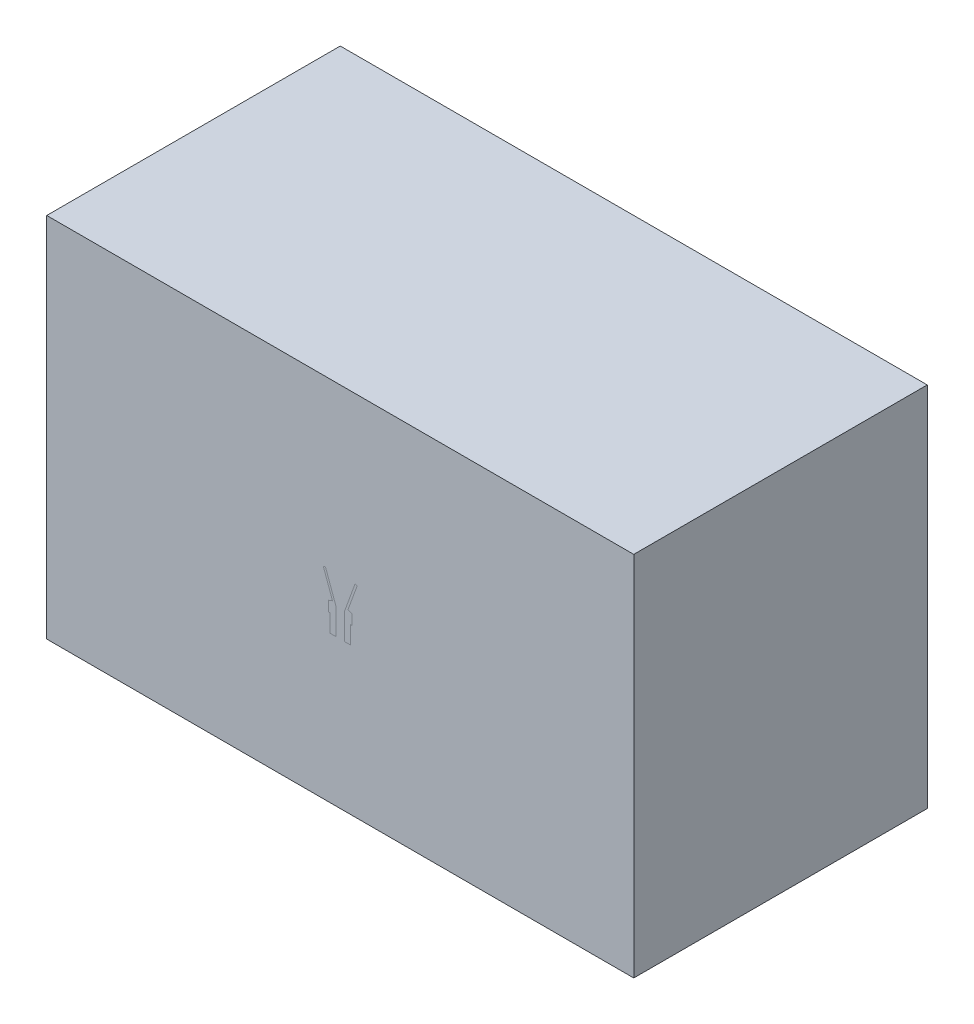
ISO-10303-21;
HEADER;
FILE_DESCRIPTION(('STEP AP214'),'2;1');
FILE_NAME('part.step','',(''),(''),'','','');
FILE_SCHEMA(('AUTOMOTIVE_DESIGN { 1 0 10303 214 1 1 1 1 }'));
ENDSEC;
DATA;
#1=APPLICATION_CONTEXT('core data for automotive mechanical design processes');
#2=APPLICATION_PROTOCOL_DEFINITION('international standard','automotive_design',2000,#1);
#3=PRODUCT_CONTEXT('',#1,'mechanical');
#4=PRODUCT('Part','Part','',(#3));
#5=PRODUCT_RELATED_PRODUCT_CATEGORY('part','',(#4));
#6=PRODUCT_DEFINITION_FORMATION('','',#4);
#7=PRODUCT_DEFINITION_CONTEXT('part definition',#1,'design');
#8=PRODUCT_DEFINITION('design','',#6,#7);
#9=PRODUCT_DEFINITION_SHAPE('','',#8);
#10=(LENGTH_UNIT() NAMED_UNIT(*) SI_UNIT(.MILLI.,.METRE.));
#11=(NAMED_UNIT(*) PLANE_ANGLE_UNIT() SI_UNIT($,.RADIAN.));
#12=(NAMED_UNIT(*) SI_UNIT($,.STERADIAN.) SOLID_ANGLE_UNIT());
#13=UNCERTAINTY_MEASURE_WITH_UNIT(LENGTH_MEASURE(1.E-05),#10,'distance_accuracy_value','');
#14=(GEOMETRIC_REPRESENTATION_CONTEXT(3) GLOBAL_UNCERTAINTY_ASSIGNED_CONTEXT((#13)) GLOBAL_UNIT_ASSIGNED_CONTEXT((#10,
#11,#12)) REPRESENTATION_CONTEXT('',''));
#15=CARTESIAN_POINT('',(0.,0.,0.));
#16=DIRECTION('',(0.,0.,1.));
#17=DIRECTION('',(1.,0.,0.));
#18=AXIS2_PLACEMENT_3D('',#15,#16,#17);
#19=CARTESIAN_POINT('',(0.,941.954291822987,0.));
#20=DIRECTION('',(0.,1.,0.));
#21=DIRECTION('',(0.,0.,1.));
#22=AXIS2_PLACEMENT_3D('',#19,#20,#21);
#23=TOROIDAL_SURFACE('',#22,265.023984913654,12.7);
#24=CARTESIAN_POINT('',(0.,946.297947643223,0.));
#25=DIRECTION('',(0.,-1.,0.));
#26=DIRECTION('',(0.,0.,-1.));
#27=AXIS2_PLACEMENT_3D('',#24,#25,#26);
#28=CIRCLE('',#27,253.089888629673);
#29=CARTESIAN_POINT('',(253.089888629673,946.297947643223,0.));
#30=VERTEX_POINT('',#29);
#31=CARTESIAN_POINT('',(-253.089888629673,946.297947643223,0.));
#32=VERTEX_POINT('',#31);
#33=EDGE_CURVE('E178',#30,#32,#28,.F.);
#34=ORIENTED_EDGE('',*,*,#33,.F.);
#35=CARTESIAN_POINT('',(265.023984913654,941.954291822987,0.));
#36=DIRECTION('',(0.,0.,1.));
#37=DIRECTION('',(1.,0.,0.));
#38=AXIS2_PLACEMENT_3D('',#35,#36,#37);
#39=CIRCLE('',#38,12.7);
#40=CARTESIAN_POINT('',(269.36764073389,953.888388106968,0.));
#41=VERTEX_POINT('',#40);
#42=EDGE_CURVE('E214',#30,#41,#39,.F.);
#43=ORIENTED_EDGE('',*,*,#42,.T.);
#44=CARTESIAN_POINT('',(0.,953.888388106968,0.));
#45=DIRECTION('',(0.,1.,0.));
#46=DIRECTION('',(0.,0.,1.));
#47=AXIS2_PLACEMENT_3D('',#44,#45,#46);
#48=CIRCLE('',#47,269.36764073389);
#49=CARTESIAN_POINT('',(-269.36764073389,953.888388106968,0.));
#50=VERTEX_POINT('',#49);
#51=EDGE_CURVE('E172',#50,#41,#48,.F.);
#52=ORIENTED_EDGE('',*,*,#51,.F.);
#53=CARTESIAN_POINT('',(-265.023984913654,941.954291822987,0.));
#54=DIRECTION('',(0.,0.,1.));
#55=DIRECTION('',(1.,0.,0.));
#56=AXIS2_PLACEMENT_3D('',#53,#54,#55);
#57=CIRCLE('',#56,12.7);
#58=EDGE_CURVE('E180',#50,#32,#57,.F.);
#59=ORIENTED_EDGE('',*,*,#58,.T.);
#60=EDGE_LOOP('',(#34,#43,#52,#59));
#61=FACE_BOUND('',#60,.T.);
#62=ADVANCED_FACE('F53',(#61),#23,.T.);
#63=CARTESIAN_POINT('',(0.,937.610636002752,0.));
#64=DIRECTION('',(0.,1.,0.));
#65=DIRECTION('',(0.,0.,1.));
#66=AXIS2_PLACEMENT_3D('',#63,#64,#65);
#67=TOROIDAL_SURFACE('',#66,276.958081197635,12.7);
#68=CARTESIAN_POINT('',(0.,949.544732286733,0.));
#69=DIRECTION('',(0.,1.,0.));
#70=DIRECTION('',(0.,0.,1.));
#71=AXIS2_PLACEMENT_3D('',#68,#69,#70);
#72=CIRCLE('',#71,281.301737017871);
#73=CARTESIAN_POINT('',(281.301737017871,949.544732286733,0.));
#74=VERTEX_POINT('',#73);
#75=CARTESIAN_POINT('',(-281.301737017871,949.544732286733,0.));
#76=VERTEX_POINT('',#75);
#77=EDGE_CURVE('E175',#74,#76,#72,.T.);
#78=ORIENTED_EDGE('',*,*,#77,.F.);
#79=CARTESIAN_POINT('',(276.958081197635,937.610636002752,0.));
#80=DIRECTION('',(0.,0.,1.));
#81=DIRECTION('',(1.,0.,0.));
#82=AXIS2_PLACEMENT_3D('',#79,#80,#81);
#83=CIRCLE('',#82,12.7);
#84=CARTESIAN_POINT('',(288.892177481616,933.266980182516,0.));
#85=VERTEX_POINT('',#84);
#86=EDGE_CURVE('E242',#74,#85,#83,.F.);
#87=ORIENTED_EDGE('',*,*,#86,.T.);
#88=CARTESIAN_POINT('',(0.,933.266980182516,0.));
#89=DIRECTION('',(0.,-1.,0.));
#90=DIRECTION('',(0.,0.,-1.));
#91=AXIS2_PLACEMENT_3D('',#88,#89,#90);
#92=CIRCLE('',#91,288.892177481616);
#93=CARTESIAN_POINT('',(-288.892177481616,933.266980182516,0.));
#94=VERTEX_POINT('',#93);
#95=EDGE_CURVE('E169',#94,#85,#92,.T.);
#96=ORIENTED_EDGE('',*,*,#95,.F.);
#97=CARTESIAN_POINT('',(-276.958081197635,937.610636002752,0.));
#98=DIRECTION('',(0.,0.,1.));
#99=DIRECTION('',(1.,0.,0.));
#100=AXIS2_PLACEMENT_3D('',#97,#98,#99);
#101=CIRCLE('',#100,12.7);
#102=EDGE_CURVE('E226',#94,#76,#101,.F.);
#103=ORIENTED_EDGE('',*,*,#102,.T.);
#104=EDGE_LOOP('',(#78,#87,#96,#103));
#105=FACE_BOUND('',#104,.T.);
#106=ADVANCED_FACE('F235',(#105),#67,.T.);
#107=CARTESIAN_POINT('',(0.,443.563884070015,0.));
#108=DIRECTION('',(0.,1.,0.));
#109=DIRECTION('',(0.,0.,1.));
#110=AXIS2_PLACEMENT_3D('',#107,#108,#109);
#111=TOROIDAL_SURFACE('',#110,151.2,76.2);
#112=CARTESIAN_POINT('',(0.,443.563884070015,0.));
#113=DIRECTION('',(0.,1.,0.));
#114=DIRECTION('',(0.,0.,1.));
#115=AXIS2_PLACEMENT_3D('',#112,#113,#114);
#116=CIRCLE('',#115,75.);
#117=CARTESIAN_POINT('',(75.,443.563884070015,0.));
#118=VERTEX_POINT('',#117);
#119=CARTESIAN_POINT('',(-75.,443.563884070015,0.));
#120=VERTEX_POINT('',#119);
#121=EDGE_CURVE('E163',#118,#120,#116,.T.);
#122=ORIENTED_EDGE('',*,*,#121,.F.);
#123=CARTESIAN_POINT('',(151.2,443.563884070015,0.));
#124=DIRECTION('',(0.,0.,1.));
#125=DIRECTION('',(1.,0.,0.));
#126=AXIS2_PLACEMENT_3D('',#123,#124,#125);
#127=CIRCLE('',#126,76.2);
#128=CARTESIAN_POINT('',(79.5954222961136,469.625818991431,0.));
#129=VERTEX_POINT('',#128);
#130=EDGE_CURVE('E244',#118,#129,#127,.F.);
#131=ORIENTED_EDGE('',*,*,#130,.T.);
#132=CARTESIAN_POINT('',(0.,469.625818991431,0.));
#133=DIRECTION('',(0.,1.,0.));
#134=DIRECTION('',(0.,0.,1.));
#135=AXIS2_PLACEMENT_3D('',#132,#133,#134);
#136=CIRCLE('',#135,79.5954222961136);
#137=CARTESIAN_POINT('',(-79.5954222961136,469.625818991431,0.));
#138=VERTEX_POINT('',#137);
#139=EDGE_CURVE('E158',#138,#129,#136,.F.);
#140=ORIENTED_EDGE('',*,*,#139,.F.);
#141=CARTESIAN_POINT('',(-151.2,443.563884070015,0.));
#142=DIRECTION('',(0.,0.,1.));
#143=DIRECTION('',(1.,0.,0.));
#144=AXIS2_PLACEMENT_3D('',#141,#142,#143);
#145=CIRCLE('',#144,76.2);
#146=EDGE_CURVE('E224',#138,#120,#145,.F.);
#147=ORIENTED_EDGE('',*,*,#146,.T.);
#148=EDGE_LOOP('',(#122,#131,#140,#147));
#149=FACE_BOUND('',#148,.T.);
#150=ADVANCED_FACE('F281',(#149),#111,.T.);
#151=CARTESIAN_POINT('',(0.,457.,0.));
#152=DIRECTION('',(0.,1.,0.));
#153=DIRECTION('',(0.,0.,1.));
#154=AXIS2_PLACEMENT_3D('',#151,#152,#153);
#155=CONICAL_SURFACE('',#154,75.,0.349065850398861);
#156=DIRECTION('',(0.342020143325664,0.93969262078591,0.));
#157=VECTOR('',#156,1.);
#158=CARTESIAN_POINT('',(0.,250.9391935409,0.));
#159=LINE('',#158,#157);
#160=EDGE_CURVE('E241',#30,#129,#159,.F.);
#161=ORIENTED_EDGE('',*,*,#160,.F.);
#162=ORIENTED_EDGE('',*,*,#33,.T.);
#163=DIRECTION('',(0.342020143325664,-0.93969262078591,0.));
#164=VECTOR('',#163,1.);
#165=CARTESIAN_POINT('',(0.,250.9391935409,0.));
#166=LINE('',#165,#164);
#167=EDGE_CURVE('E186',#138,#32,#166,.F.);
#168=ORIENTED_EDGE('',*,*,#167,.F.);
#169=ORIENTED_EDGE('',*,*,#139,.T.);
#170=EDGE_LOOP('',(#161,#162,#168,#169));
#171=FACE_BOUND('',#170,.T.);
#172=ADVANCED_FACE('F273',(#171),#155,.F.);
#173=CARTESIAN_POINT('',(0.,958.232043927204,0.));
#174=DIRECTION('',(0.,-1.,0.));
#175=DIRECTION('',(0.,0.,-1.));
#176=AXIS2_PLACEMENT_3D('',#173,#174,#175);
#177=CONICAL_SURFACE('',#176,257.433544449909,1.22173047639604);
#178=DIRECTION('',(-0.93969262078591,-0.342020143325664,0.));
#179=VECTOR('',#178,1.);
#180=CARTESIAN_POINT('',(0.,1051.93019140862,0.));
#181=LINE('',#180,#179);
#182=EDGE_CURVE('E190',#50,#76,#181,.T.);
#183=ORIENTED_EDGE('',*,*,#182,.F.);
#184=ORIENTED_EDGE('',*,*,#51,.T.);
#185=DIRECTION('',(-0.93969262078591,0.342020143325664,0.));
#186=VECTOR('',#185,1.);
#187=CARTESIAN_POINT('',(0.,1051.93019140862,0.));
#188=LINE('',#187,#186);
#189=EDGE_CURVE('E239',#74,#41,#188,.T.);
#190=ORIENTED_EDGE('',*,*,#189,.F.);
#191=ORIENTED_EDGE('',*,*,#77,.T.);
#192=EDGE_LOOP('',(#183,#184,#190,#191));
#193=FACE_BOUND('',#192,.T.);
#194=ADVANCED_FACE('F238',(#193),#177,.T.);
#195=CARTESIAN_POINT('',(0.,945.201076466497,0.));
#196=DIRECTION('',(0.,1.,0.));
#197=DIRECTION('',(0.,0.,1.));
#198=AXIS2_PLACEMENT_3D('',#195,#196,#197);
#199=CONICAL_SURFACE('',#198,293.235833301852,0.34906585039886);
#200=DIRECTION('',(0.342020143325663,0.93969262078591,0.));
#201=VECTOR('',#200,1.);
#202=CARTESIAN_POINT('',(0.,139.542245894684,0.));
#203=LINE('',#202,#201);
#204=CARTESIAN_POINT('',(133.634704911401,506.700580094249,0.));
#205=VERTEX_POINT('',#204);
#206=EDGE_CURVE('E249',#205,#85,#203,.T.);
#207=ORIENTED_EDGE('',*,*,#206,.F.);
#208=CARTESIAN_POINT('',(0.,506.700580094249,0.));
#209=DIRECTION('',(0.,-1.,0.));
#210=DIRECTION('',(0.,0.,-1.));
#211=AXIS2_PLACEMENT_3D('',#208,#209,#210);
#212=CIRCLE('',#211,133.634704911402);
#213=CARTESIAN_POINT('',(-133.634704911401,506.700580094249,0.));
#214=VERTEX_POINT('',#213);
#215=EDGE_CURVE('E146',#214,#205,#212,.T.);
#216=ORIENTED_EDGE('',*,*,#215,.F.);
#217=DIRECTION('',(0.342020143325663,-0.93969262078591,0.));
#218=VECTOR('',#217,1.);
#219=CARTESIAN_POINT('',(0.,139.542245894684,0.));
#220=LINE('',#219,#218);
#221=EDGE_CURVE('E222',#94,#214,#220,.T.);
#222=ORIENTED_EDGE('',*,*,#221,.F.);
#223=ORIENTED_EDGE('',*,*,#95,.T.);
#224=EDGE_LOOP('',(#207,#216,#222,#223));
#225=FACE_BOUND('',#224,.T.);
#226=ADVANCED_FACE('F265',(#225),#199,.T.);
#227=CARTESIAN_POINT('',(0.,506.700580094249,0.));
#228=DIRECTION('',(0.,-1.,0.));
#229=DIRECTION('',(0.,0.,-1.));
#230=AXIS2_PLACEMENT_3D('',#227,#228,#229);
#231=CONICAL_SURFACE('',#230,133.634704911402,1.22173047639604);
#232=DIRECTION('',(-0.93969262078591,-0.342020143325663,0.));
#233=VECTOR('',#232,1.);
#234=CARTESIAN_POINT('',(0.,555.339634946945,0.));
#235=LINE('',#234,#233);
#236=CARTESIAN_POINT('',(-200.4,482.4,0.));
#237=VERTEX_POINT('',#236);
#238=EDGE_CURVE('E220',#214,#237,#235,.T.);
#239=ORIENTED_EDGE('',*,*,#238,.F.);
#240=ORIENTED_EDGE('',*,*,#215,.T.);
#241=DIRECTION('',(-0.93969262078591,0.342020143325663,0.));
#242=VECTOR('',#241,1.);
#243=CARTESIAN_POINT('',(0.,555.339634946945,0.));
#244=LINE('',#243,#242);
#245=CARTESIAN_POINT('',(200.4,482.4,0.));
#246=VERTEX_POINT('',#245);
#247=EDGE_CURVE('E251',#246,#205,#244,.T.);
#248=ORIENTED_EDGE('',*,*,#247,.F.);
#249=CARTESIAN_POINT('',(0.,482.4,0.));
#250=DIRECTION('',(0.,-1.,0.));
#251=DIRECTION('',(0.,0.,-1.));
#252=AXIS2_PLACEMENT_3D('',#249,#250,#251);
#253=CIRCLE('',#252,200.4);
#254=EDGE_CURVE('E196',#237,#246,#253,.T.);
#255=ORIENTED_EDGE('',*,*,#254,.F.);
#256=EDGE_LOOP('',(#239,#240,#248,#255));
#257=FACE_BOUND('',#256,.T.);
#258=ADVANCED_FACE('F260',(#257),#231,.T.);
#259=CARTESIAN_POINT('',(0.,0.,0.));
#260=DIRECTION('',(0.,-1.,0.));
#261=DIRECTION('',(0.,0.,-1.));
#262=AXIS2_PLACEMENT_3D('',#259,#260,#261);
#263=CYLINDRICAL_SURFACE('',#262,200.4);
#264=DIRECTION('',(0.,-1.,0.));
#265=VECTOR('',#264,1.);
#266=CARTESIAN_POINT('',(-200.4,0.,0.));
#267=LINE('',#266,#265);
#268=CARTESIAN_POINT('',(-200.4,307.,0.));
#269=VERTEX_POINT('',#268);
#270=EDGE_CURVE('E213',#237,#269,#267,.T.);
#271=ORIENTED_EDGE('',*,*,#270,.F.);
#272=ORIENTED_EDGE('',*,*,#254,.T.);
#273=DIRECTION('',(0.,-1.,0.));
#274=VECTOR('',#273,1.);
#275=CARTESIAN_POINT('',(200.4,0.,0.));
#276=LINE('',#275,#274);
#277=CARTESIAN_POINT('',(200.4,307.,0.));
#278=VERTEX_POINT('',#277);
#279=EDGE_CURVE('E153',#278,#246,#276,.F.);
#280=ORIENTED_EDGE('',*,*,#279,.F.);
#281=CARTESIAN_POINT('',(0.,307.,0.));
#282=DIRECTION('',(0.,-1.,0.));
#283=DIRECTION('',(0.,0.,-1.));
#284=AXIS2_PLACEMENT_3D('',#281,#282,#283);
#285=CIRCLE('',#284,200.4);
#286=EDGE_CURVE('E152',#269,#278,#285,.T.);
#287=ORIENTED_EDGE('',*,*,#286,.F.);
#288=EDGE_LOOP('',(#271,#272,#280,#287));
#289=FACE_BOUND('',#288,.T.);
#290=ADVANCED_FACE('F263',(#289),#263,.T.);
#291=CARTESIAN_POINT('',(-175.,307.,0.));
#292=DIRECTION('',(0.,1.,0.));
#293=DIRECTION('',(0.,0.,1.));
#294=AXIS2_PLACEMENT_3D('',#291,#292,#293);
#295=PLANE('',#294);
#296=DIRECTION('',(1.,0.,0.));
#297=VECTOR('',#296,1.);
#298=CARTESIAN_POINT('',(-175.,307.,0.));
#299=LINE('',#298,#297);
#300=CARTESIAN_POINT('',(-175.,307.,0.));
#301=VERTEX_POINT('',#300);
#302=EDGE_CURVE('E75',#269,#301,#299,.T.);
#303=ORIENTED_EDGE('',*,*,#302,.F.);
#304=ORIENTED_EDGE('',*,*,#286,.T.);
#305=CARTESIAN_POINT('',(175.,307.,0.));
#306=VERTEX_POINT('',#305);
#307=EDGE_CURVE('E140',#306,#278,#299,.T.);
#308=ORIENTED_EDGE('',*,*,#307,.F.);
#309=CARTESIAN_POINT('',(0.,307.,0.));
#310=DIRECTION('',(0.,1.,0.));
#311=DIRECTION('',(0.,0.,1.));
#312=AXIS2_PLACEMENT_3D('',#309,#310,#311);
#313=CIRCLE('',#312,175.);
#314=EDGE_CURVE('E150',#306,#301,#313,.T.);
#315=ORIENTED_EDGE('',*,*,#314,.T.);
#316=EDGE_LOOP('',(#303,#304,#308,#315));
#317=FACE_BOUND('',#316,.T.);
#318=ADVANCED_FACE('F55',(#317),#295,.F.);
#319=CARTESIAN_POINT('',(0.,457.,0.));
#320=DIRECTION('',(0.,-1.,0.));
#321=DIRECTION('',(0.,0.,-1.));
#322=AXIS2_PLACEMENT_3D('',#319,#320,#321);
#323=CYLINDRICAL_SURFACE('',#322,75.);
#324=ORIENTED_EDGE('',*,*,#121,.T.);
#325=DIRECTION('',(0.,-1.,0.));
#326=VECTOR('',#325,1.);
#327=CARTESIAN_POINT('',(-75.,457.,0.));
#328=LINE('',#327,#326);
#329=CARTESIAN_POINT('',(-75.,0.,0.));
#330=VERTEX_POINT('',#329);
#331=EDGE_CURVE('E210',#120,#330,#328,.T.);
#332=ORIENTED_EDGE('',*,*,#331,.T.);
#333=CARTESIAN_POINT('',(0.,0.,0.));
#334=DIRECTION('',(0.,1.,0.));
#335=DIRECTION('',(0.,0.,1.));
#336=AXIS2_PLACEMENT_3D('',#333,#334,#335);
#337=CIRCLE('',#336,75.);
#338=CARTESIAN_POINT('',(75.,0.,0.));
#339=VERTEX_POINT('',#338);
#340=EDGE_CURVE('E160',#339,#330,#337,.T.);
#341=ORIENTED_EDGE('',*,*,#340,.F.);
#342=DIRECTION('',(0.,-1.,0.));
#343=VECTOR('',#342,1.);
#344=CARTESIAN_POINT('',(75.,457.,0.));
#345=LINE('',#344,#343);
#346=EDGE_CURVE('E154',#339,#118,#345,.F.);
#347=ORIENTED_EDGE('',*,*,#346,.T.);
#348=EDGE_LOOP('',(#324,#332,#341,#347));
#349=FACE_BOUND('',#348,.T.);
#350=ADVANCED_FACE('F208',(#349),#323,.F.);
#351=CARTESIAN_POINT('',(0.,0.,0.));
#352=DIRECTION('',(0.,1.,0.));
#353=DIRECTION('',(0.,0.,1.));
#354=AXIS2_PLACEMENT_3D('',#351,#352,#353);
#355=PLANE('',#354);
#356=DIRECTION('',(1.,0.,0.));
#357=VECTOR('',#356,1.);
#358=CARTESIAN_POINT('',(0.,0.,0.));
#359=LINE('',#358,#357);
#360=CARTESIAN_POINT('',(-175.,0.,0.));
#361=VERTEX_POINT('',#360);
#362=EDGE_CURVE('E204',#361,#330,#359,.T.);
#363=ORIENTED_EDGE('',*,*,#362,.F.);
#364=CARTESIAN_POINT('',(0.,0.,0.));
#365=DIRECTION('',(0.,1.,0.));
#366=DIRECTION('',(0.,0.,1.));
#367=AXIS2_PLACEMENT_3D('',#364,#365,#366);
#368=CIRCLE('',#367,175.);
#369=CARTESIAN_POINT('',(175.,0.,0.));
#370=VERTEX_POINT('',#369);
#371=EDGE_CURVE('E157',#370,#361,#368,.T.);
#372=ORIENTED_EDGE('',*,*,#371,.F.);
#373=EDGE_CURVE('E68',#339,#370,#359,.T.);
#374=ORIENTED_EDGE('',*,*,#373,.F.);
#375=ORIENTED_EDGE('',*,*,#340,.T.);
#376=EDGE_LOOP('',(#363,#372,#374,#375));
#377=FACE_BOUND('',#376,.T.);
#378=ADVANCED_FACE('F203',(#377),#355,.F.);
#379=CARTESIAN_POINT('',(0.,457.,0.));
#380=DIRECTION('',(0.,-1.,0.));
#381=DIRECTION('',(0.,0.,-1.));
#382=AXIS2_PLACEMENT_3D('',#379,#380,#381);
#383=CYLINDRICAL_SURFACE('',#382,175.);
#384=DIRECTION('',(0.,-1.,0.));
#385=VECTOR('',#384,1.);
#386=CARTESIAN_POINT('',(-175.,457.,0.));
#387=LINE('',#386,#385);
#388=EDGE_CURVE('E12',#301,#361,#387,.T.);
#389=ORIENTED_EDGE('',*,*,#388,.F.);
#390=ORIENTED_EDGE('',*,*,#314,.F.);
#391=DIRECTION('',(0.,-1.,0.));
#392=VECTOR('',#391,1.);
#393=CARTESIAN_POINT('',(175.,457.,0.));
#394=LINE('',#393,#392);
#395=EDGE_CURVE('E61',#370,#306,#394,.F.);
#396=ORIENTED_EDGE('',*,*,#395,.F.);
#397=ORIENTED_EDGE('',*,*,#371,.T.);
#398=EDGE_LOOP('',(#389,#390,#396,#397));
#399=FACE_BOUND('',#398,.T.);
#400=ADVANCED_FACE('F156',(#399),#383,.T.);
#401=CARTESIAN_POINT('',(0.,0.,0.));
#402=DIRECTION('',(0.,0.,1.));
#403=DIRECTION('',(1.,0.,0.));
#404=AXIS2_PLACEMENT_3D('',#401,#402,#403);
#405=PLANE('',#404);
#406=ORIENTED_EDGE('',*,*,#160,.T.);
#407=ORIENTED_EDGE('',*,*,#130,.F.);
#408=ORIENTED_EDGE('',*,*,#346,.F.);
#409=ORIENTED_EDGE('',*,*,#373,.T.);
#410=ORIENTED_EDGE('',*,*,#395,.T.);
#411=ORIENTED_EDGE('',*,*,#307,.T.);
#412=ORIENTED_EDGE('',*,*,#279,.T.);
#413=ORIENTED_EDGE('',*,*,#247,.T.);
#414=ORIENTED_EDGE('',*,*,#206,.T.);
#415=ORIENTED_EDGE('',*,*,#86,.F.);
#416=ORIENTED_EDGE('',*,*,#189,.T.);
#417=ORIENTED_EDGE('',*,*,#42,.F.);
#418=EDGE_LOOP('',(#406,#407,#408,#409,#410,#411,#412,#413,#414,#415,#416,#417));
#419=FACE_BOUND('',#418,.T.);
#420=ADVANCED_FACE('F139',(#419),#405,.T.);
#421=ORIENTED_EDGE('',*,*,#182,.T.);
#422=ORIENTED_EDGE('',*,*,#102,.F.);
#423=ORIENTED_EDGE('',*,*,#221,.T.);
#424=ORIENTED_EDGE('',*,*,#238,.T.);
#425=ORIENTED_EDGE('',*,*,#270,.T.);
#426=ORIENTED_EDGE('',*,*,#302,.T.);
#427=ORIENTED_EDGE('',*,*,#388,.T.);
#428=ORIENTED_EDGE('',*,*,#362,.T.);
#429=ORIENTED_EDGE('',*,*,#331,.F.);
#430=ORIENTED_EDGE('',*,*,#146,.F.);
#431=ORIENTED_EDGE('',*,*,#167,.T.);
#432=ORIENTED_EDGE('',*,*,#58,.F.);
#433=EDGE_LOOP('',(#421,#422,#423,#424,#425,#426,#427,#428,#429,#430,#431,#432));
#434=FACE_BOUND('',#433,.T.);
#435=ADVANCED_FACE('F229',(#434),#405,.T.);
#436=CLOSED_SHELL('',(#62,#106,#150,#172,#194,#226,#258,#290,#318,#350,#378,#400,#420,#435));
#437=MANIFOLD_SOLID_BREP('B2',#436);
#438=CARTESIAN_POINT('',(0.,941.954291822987,0.));
#439=DIRECTION('',(0.,1.,0.));
#440=DIRECTION('',(0.,0.,1.));
#441=AXIS2_PLACEMENT_3D('',#438,#439,#440);
#442=TOROIDAL_SURFACE('',#441,265.023984913654,12.7);
#443=CARTESIAN_POINT('',(265.023984913654,941.954291822987,0.));
#444=DIRECTION('',(0.,0.,1.));
#445=DIRECTION('',(1.,0.,0.));
#446=AXIS2_PLACEMENT_3D('',#443,#444,#445);
#447=CIRCLE('',#446,12.7);
#448=CARTESIAN_POINT('',(253.089888629673,946.297947643223,0.));
#449=VERTEX_POINT('',#448);
#450=CARTESIAN_POINT('',(269.36764073389,953.888388106968,0.));
#451=VERTEX_POINT('',#450);
#452=EDGE_CURVE('E617',#449,#451,#447,.F.);
#453=ORIENTED_EDGE('',*,*,#452,.F.);
#454=CARTESIAN_POINT('',(0.,946.297947643223,0.));
#455=DIRECTION('',(0.,-1.,0.));
#456=DIRECTION('',(0.,0.,-1.));
#457=AXIS2_PLACEMENT_3D('',#454,#455,#456);
#458=CIRCLE('',#457,253.089888629673);
#459=CARTESIAN_POINT('',(-253.089888629673,946.297947643223,0.));
#460=VERTEX_POINT('',#459);
#461=EDGE_CURVE('E559',#449,#460,#458,.F.);
#462=ORIENTED_EDGE('',*,*,#461,.T.);
#463=CARTESIAN_POINT('',(-265.023984913654,941.954291822987,0.));
#464=DIRECTION('',(0.,0.,1.));
#465=DIRECTION('',(1.,0.,0.));
#466=AXIS2_PLACEMENT_3D('',#463,#464,#465);
#467=CIRCLE('',#466,12.7);
#468=CARTESIAN_POINT('',(-269.36764073389,953.888388106968,0.));
#469=VERTEX_POINT('',#468);
#470=EDGE_CURVE('E642',#469,#460,#467,.F.);
#471=ORIENTED_EDGE('',*,*,#470,.F.);
#472=CARTESIAN_POINT('',(0.,953.888388106968,0.));
#473=DIRECTION('',(0.,1.,0.));
#474=DIRECTION('',(0.,0.,1.));
#475=AXIS2_PLACEMENT_3D('',#472,#473,#474);
#476=CIRCLE('',#475,269.36764073389);
#477=EDGE_CURVE('E551',#469,#451,#476,.F.);
#478=ORIENTED_EDGE('',*,*,#477,.T.);
#479=EDGE_LOOP('',(#453,#462,#471,#478));
#480=FACE_BOUND('',#479,.T.);
#481=ADVANCED_FACE('F395',(#480),#442,.F.);
#482=CARTESIAN_POINT('',(0.,937.610636002752,0.));
#483=DIRECTION('',(0.,1.,0.));
#484=DIRECTION('',(0.,0.,1.));
#485=AXIS2_PLACEMENT_3D('',#482,#483,#484);
#486=TOROIDAL_SURFACE('',#485,276.958081197635,12.7);
#487=CARTESIAN_POINT('',(276.958081197635,937.610636002752,0.));
#488=DIRECTION('',(0.,0.,1.));
#489=DIRECTION('',(1.,0.,0.));
#490=AXIS2_PLACEMENT_3D('',#487,#488,#489);
#491=CIRCLE('',#490,12.7);
#492=CARTESIAN_POINT('',(281.301737017871,949.544732286733,0.));
#493=VERTEX_POINT('',#492);
#494=CARTESIAN_POINT('',(288.892177481616,933.266980182516,0.));
#495=VERTEX_POINT('',#494);
#496=EDGE_CURVE('E720',#493,#495,#491,.F.);
#497=ORIENTED_EDGE('',*,*,#496,.F.);
#498=CARTESIAN_POINT('',(0.,949.544732286733,0.));
#499=DIRECTION('',(0.,1.,0.));
#500=DIRECTION('',(0.,0.,1.));
#501=AXIS2_PLACEMENT_3D('',#498,#499,#500);
#502=CIRCLE('',#501,281.301737017871);
#503=CARTESIAN_POINT('',(-281.301737017871,949.544732286733,0.));
#504=VERTEX_POINT('',#503);
#505=EDGE_CURVE('E555',#493,#504,#502,.T.);
#506=ORIENTED_EDGE('',*,*,#505,.T.);
#507=CARTESIAN_POINT('',(-276.958081197635,937.610636002752,0.));
#508=DIRECTION('',(0.,0.,1.));
#509=DIRECTION('',(1.,0.,0.));
#510=AXIS2_PLACEMENT_3D('',#507,#508,#509);
#511=CIRCLE('',#510,12.7);
#512=CARTESIAN_POINT('',(-288.892177481616,933.266980182516,0.));
#513=VERTEX_POINT('',#512);
#514=EDGE_CURVE('E631',#513,#504,#511,.F.);
#515=ORIENTED_EDGE('',*,*,#514,.F.);
#516=CARTESIAN_POINT('',(0.,933.266980182516,0.));
#517=DIRECTION('',(0.,-1.,0.));
#518=DIRECTION('',(0.,0.,-1.));
#519=AXIS2_PLACEMENT_3D('',#516,#517,#518);
#520=CIRCLE('',#519,288.892177481616);
#521=EDGE_CURVE('E547',#513,#495,#520,.T.);
#522=ORIENTED_EDGE('',*,*,#521,.T.);
#523=EDGE_LOOP('',(#497,#506,#515,#522));
#524=FACE_BOUND('',#523,.T.);
#525=ADVANCED_FACE('F698',(#524),#486,.F.);
#526=CARTESIAN_POINT('',(0.,443.563884070015,0.));
#527=DIRECTION('',(0.,1.,0.));
#528=DIRECTION('',(0.,0.,1.));
#529=AXIS2_PLACEMENT_3D('',#526,#527,#528);
#530=TOROIDAL_SURFACE('',#529,151.2,76.2);
#531=CARTESIAN_POINT('',(151.2,443.563884070015,0.));
#532=DIRECTION('',(0.,0.,1.));
#533=DIRECTION('',(1.,0.,0.));
#534=AXIS2_PLACEMENT_3D('',#531,#532,#533);
#535=CIRCLE('',#534,76.2);
#536=CARTESIAN_POINT('',(75.,443.563884070015,0.));
#537=VERTEX_POINT('',#536);
#538=CARTESIAN_POINT('',(79.5954222961136,469.625818991431,0.));
#539=VERTEX_POINT('',#538);
#540=EDGE_CURVE('E716',#537,#539,#535,.F.);
#541=ORIENTED_EDGE('',*,*,#540,.F.);
#542=CARTESIAN_POINT('',(0.,443.563884070015,0.));
#543=DIRECTION('',(0.,1.,0.));
#544=DIRECTION('',(0.,0.,1.));
#545=AXIS2_PLACEMENT_3D('',#542,#543,#544);
#546=CIRCLE('',#545,75.);
#547=CARTESIAN_POINT('',(-75.,443.563884070015,0.));
#548=VERTEX_POINT('',#547);
#549=EDGE_CURVE('E543',#537,#548,#546,.T.);
#550=ORIENTED_EDGE('',*,*,#549,.T.);
#551=CARTESIAN_POINT('',(-151.2,443.563884070015,0.));
#552=DIRECTION('',(0.,0.,1.));
#553=DIRECTION('',(1.,0.,0.));
#554=AXIS2_PLACEMENT_3D('',#551,#552,#553);
#555=CIRCLE('',#554,76.2);
#556=CARTESIAN_POINT('',(-79.5954222961136,469.625818991431,0.));
#557=VERTEX_POINT('',#556);
#558=EDGE_CURVE('E628',#557,#548,#555,.F.);
#559=ORIENTED_EDGE('',*,*,#558,.F.);
#560=CARTESIAN_POINT('',(0.,469.625818991431,0.));
#561=DIRECTION('',(0.,1.,0.));
#562=DIRECTION('',(0.,0.,1.));
#563=AXIS2_PLACEMENT_3D('',#560,#561,#562);
#564=CIRCLE('',#563,79.5954222961136);
#565=EDGE_CURVE('E536',#557,#539,#564,.F.);
#566=ORIENTED_EDGE('',*,*,#565,.T.);
#567=EDGE_LOOP('',(#541,#550,#559,#566));
#568=FACE_BOUND('',#567,.T.);
#569=ADVANCED_FACE('F702',(#568),#530,.F.);
#570=CARTESIAN_POINT('',(0.,457.,0.));
#571=DIRECTION('',(0.,1.,0.));
#572=DIRECTION('',(0.,0.,1.));
#573=AXIS2_PLACEMENT_3D('',#570,#571,#572);
#574=CONICAL_SURFACE('',#573,75.,0.349065850398861);
#575=ORIENTED_EDGE('',*,*,#461,.F.);
#576=DIRECTION('',(0.342020143325664,0.93969262078591,0.));
#577=VECTOR('',#576,1.);
#578=CARTESIAN_POINT('',(0.,250.9391935409,0.));
#579=LINE('',#578,#577);
#580=EDGE_CURVE('E707',#449,#539,#579,.F.);
#581=ORIENTED_EDGE('',*,*,#580,.T.);
#582=ORIENTED_EDGE('',*,*,#565,.F.);
#583=DIRECTION('',(0.342020143325664,-0.93969262078591,0.));
#584=VECTOR('',#583,1.);
#585=CARTESIAN_POINT('',(0.,250.9391935409,0.));
#586=LINE('',#585,#584);
#587=EDGE_CURVE('E638',#557,#460,#586,.F.);
#588=ORIENTED_EDGE('',*,*,#587,.T.);
#589=EDGE_LOOP('',(#575,#581,#582,#588));
#590=FACE_BOUND('',#589,.T.);
#591=ADVANCED_FACE('F710',(#590),#574,.T.);
#592=CARTESIAN_POINT('',(0.,958.232043927204,0.));
#593=DIRECTION('',(0.,-1.,0.));
#594=DIRECTION('',(0.,0.,-1.));
#595=AXIS2_PLACEMENT_3D('',#592,#593,#594);
#596=CONICAL_SURFACE('',#595,257.433544449909,1.22173047639604);
#597=ORIENTED_EDGE('',*,*,#477,.F.);
#598=DIRECTION('',(-0.93969262078591,-0.342020143325664,0.));
#599=VECTOR('',#598,1.);
#600=CARTESIAN_POINT('',(0.,1051.93019140862,0.));
#601=LINE('',#600,#599);
#602=EDGE_CURVE('E634',#469,#504,#601,.T.);
#603=ORIENTED_EDGE('',*,*,#602,.T.);
#604=ORIENTED_EDGE('',*,*,#505,.F.);
#605=DIRECTION('',(-0.93969262078591,0.342020143325664,0.));
#606=VECTOR('',#605,1.);
#607=CARTESIAN_POINT('',(0.,1051.93019140862,0.));
#608=LINE('',#607,#606);
#609=EDGE_CURVE('E725',#493,#451,#608,.T.);
#610=ORIENTED_EDGE('',*,*,#609,.T.);
#611=EDGE_LOOP('',(#597,#603,#604,#610));
#612=FACE_BOUND('',#611,.T.);
#613=ADVANCED_FACE('F735',(#612),#596,.F.);
#614=CARTESIAN_POINT('',(0.,945.201076466497,0.));
#615=DIRECTION('',(0.,1.,0.));
#616=DIRECTION('',(0.,0.,1.));
#617=AXIS2_PLACEMENT_3D('',#614,#615,#616);
#618=CONICAL_SURFACE('',#617,293.235833301852,0.34906585039886);
#619=CARTESIAN_POINT('',(0.,506.700580094249,0.));
#620=DIRECTION('',(0.,-1.,0.));
#621=DIRECTION('',(0.,0.,-1.));
#622=AXIS2_PLACEMENT_3D('',#619,#620,#621);
#623=CIRCLE('',#622,133.634704911402);
#624=CARTESIAN_POINT('',(-133.634704911401,506.700580094249,0.));
#625=VERTEX_POINT('',#624);
#626=CARTESIAN_POINT('',(133.634704911401,506.700580094249,0.));
#627=VERTEX_POINT('',#626);
#628=EDGE_CURVE('E515',#625,#627,#623,.T.);
#629=ORIENTED_EDGE('',*,*,#628,.T.);
#630=DIRECTION('',(0.342020143325663,0.93969262078591,0.));
#631=VECTOR('',#630,1.);
#632=CARTESIAN_POINT('',(0.,139.542245894684,0.));
#633=LINE('',#632,#631);
#634=EDGE_CURVE('E721',#627,#495,#633,.T.);
#635=ORIENTED_EDGE('',*,*,#634,.T.);
#636=ORIENTED_EDGE('',*,*,#521,.F.);
#637=DIRECTION('',(0.342020143325663,-0.93969262078591,0.));
#638=VECTOR('',#637,1.);
#639=CARTESIAN_POINT('',(0.,139.542245894684,0.));
#640=LINE('',#639,#638);
#641=EDGE_CURVE('E624',#513,#625,#640,.T.);
#642=ORIENTED_EDGE('',*,*,#641,.T.);
#643=EDGE_LOOP('',(#629,#635,#636,#642));
#644=FACE_BOUND('',#643,.T.);
#645=ADVANCED_FACE('F740',(#644),#618,.F.);
#646=CARTESIAN_POINT('',(0.,506.700580094249,0.));
#647=DIRECTION('',(0.,-1.,0.));
#648=DIRECTION('',(0.,0.,-1.));
#649=AXIS2_PLACEMENT_3D('',#646,#647,#648);
#650=CONICAL_SURFACE('',#649,133.634704911402,1.22173047639604);
#651=ORIENTED_EDGE('',*,*,#628,.F.);
#652=DIRECTION('',(-0.93969262078591,-0.342020143325663,0.));
#653=VECTOR('',#652,1.);
#654=CARTESIAN_POINT('',(0.,555.339634946945,0.));
#655=LINE('',#654,#653);
#656=CARTESIAN_POINT('',(-200.4,482.4,0.));
#657=VERTEX_POINT('',#656);
#658=EDGE_CURVE('E612',#625,#657,#655,.T.);
#659=ORIENTED_EDGE('',*,*,#658,.T.);
#660=CARTESIAN_POINT('',(0.,482.4,0.));
#661=DIRECTION('',(0.,-1.,0.));
#662=DIRECTION('',(0.,0.,-1.));
#663=AXIS2_PLACEMENT_3D('',#660,#661,#662);
#664=CIRCLE('',#663,200.4);
#665=CARTESIAN_POINT('',(200.4,482.4,0.));
#666=VERTEX_POINT('',#665);
#667=EDGE_CURVE('E584',#657,#666,#664,.T.);
#668=ORIENTED_EDGE('',*,*,#667,.T.);
#669=DIRECTION('',(-0.93969262078591,0.342020143325663,0.));
#670=VECTOR('',#669,1.);
#671=CARTESIAN_POINT('',(0.,555.339634946945,0.));
#672=LINE('',#671,#670);
#673=EDGE_CURVE('E605',#666,#627,#672,.T.);
#674=ORIENTED_EDGE('',*,*,#673,.T.);
#675=EDGE_LOOP('',(#651,#659,#668,#674));
#676=FACE_BOUND('',#675,.T.);
#677=ADVANCED_FACE('F744',(#676),#650,.F.);
#678=CARTESIAN_POINT('',(0.,0.,0.));
#679=DIRECTION('',(0.,-1.,0.));
#680=DIRECTION('',(0.,0.,-1.));
#681=AXIS2_PLACEMENT_3D('',#678,#679,#680);
#682=CYLINDRICAL_SURFACE('',#681,200.4);
#683=ORIENTED_EDGE('',*,*,#667,.F.);
#684=DIRECTION('',(0.,-1.,0.));
#685=VECTOR('',#684,1.);
#686=CARTESIAN_POINT('',(-200.4,0.,0.));
#687=LINE('',#686,#685);
#688=CARTESIAN_POINT('',(-200.4,307.,0.));
#689=VERTEX_POINT('',#688);
#690=EDGE_CURVE('E596',#657,#689,#687,.T.);
#691=ORIENTED_EDGE('',*,*,#690,.T.);
#692=CARTESIAN_POINT('',(0.,307.,0.));
#693=DIRECTION('',(0.,-1.,0.));
#694=DIRECTION('',(0.,0.,-1.));
#695=AXIS2_PLACEMENT_3D('',#692,#693,#694);
#696=CIRCLE('',#695,200.4);
#697=CARTESIAN_POINT('',(200.4,307.,0.));
#698=VERTEX_POINT('',#697);
#699=EDGE_CURVE('E534',#689,#698,#696,.T.);
#700=ORIENTED_EDGE('',*,*,#699,.T.);
#701=DIRECTION('',(0.,-1.,0.));
#702=VECTOR('',#701,1.);
#703=CARTESIAN_POINT('',(200.4,0.,0.));
#704=LINE('',#703,#702);
#705=EDGE_CURVE('E595',#698,#666,#704,.F.);
#706=ORIENTED_EDGE('',*,*,#705,.T.);
#707=EDGE_LOOP('',(#683,#691,#700,#706));
#708=FACE_BOUND('',#707,.T.);
#709=ADVANCED_FACE('F594',(#708),#682,.F.);
#710=CARTESIAN_POINT('',(-175.,307.,0.));
#711=DIRECTION('',(0.,1.,0.));
#712=DIRECTION('',(0.,0.,1.));
#713=AXIS2_PLACEMENT_3D('',#710,#711,#712);
#714=PLANE('',#713);
#715=ORIENTED_EDGE('',*,*,#699,.F.);
#716=DIRECTION('',(1.,0.,0.));
#717=VECTOR('',#716,1.);
#718=CARTESIAN_POINT('',(-175.,307.,0.));
#719=LINE('',#718,#717);
#720=CARTESIAN_POINT('',(-175.,307.,0.));
#721=VERTEX_POINT('',#720);
#722=EDGE_CURVE('E600',#689,#721,#719,.T.);
#723=ORIENTED_EDGE('',*,*,#722,.T.);
#724=CARTESIAN_POINT('',(0.,307.,0.));
#725=DIRECTION('',(0.,1.,0.));
#726=DIRECTION('',(0.,0.,1.));
#727=AXIS2_PLACEMENT_3D('',#724,#725,#726);
#728=CIRCLE('',#727,175.);
#729=CARTESIAN_POINT('',(175.,307.,0.));
#730=VERTEX_POINT('',#729);
#731=EDGE_CURVE('E530',#730,#721,#728,.T.);
#732=ORIENTED_EDGE('',*,*,#731,.F.);
#733=EDGE_CURVE('E418',#730,#698,#719,.T.);
#734=ORIENTED_EDGE('',*,*,#733,.T.);
#735=EDGE_LOOP('',(#715,#723,#732,#734));
#736=FACE_BOUND('',#735,.T.);
#737=ADVANCED_FACE('F599',(#736),#714,.T.);
#738=CARTESIAN_POINT('',(0.,457.,0.));
#739=DIRECTION('',(0.,-1.,0.));
#740=DIRECTION('',(0.,0.,-1.));
#741=AXIS2_PLACEMENT_3D('',#738,#739,#740);
#742=CYLINDRICAL_SURFACE('',#741,75.);
#743=DIRECTION('',(0.,-1.,0.));
#744=VECTOR('',#743,1.);
#745=CARTESIAN_POINT('',(-75.,457.,0.));
#746=LINE('',#745,#744);
#747=CARTESIAN_POINT('',(-75.,0.,0.));
#748=VERTEX_POINT('',#747);
#749=EDGE_CURVE('E609',#548,#748,#746,.T.);
#750=ORIENTED_EDGE('',*,*,#749,.F.);
#751=ORIENTED_EDGE('',*,*,#549,.F.);
#752=DIRECTION('',(0.,-1.,0.));
#753=VECTOR('',#752,1.);
#754=CARTESIAN_POINT('',(75.,457.,0.));
#755=LINE('',#754,#753);
#756=CARTESIAN_POINT('',(75.,0.,0.));
#757=VERTEX_POINT('',#756);
#758=EDGE_CURVE('E525',#757,#537,#755,.F.);
#759=ORIENTED_EDGE('',*,*,#758,.F.);
#760=CARTESIAN_POINT('',(0.,0.,0.));
#761=DIRECTION('',(0.,1.,0.));
#762=DIRECTION('',(0.,0.,1.));
#763=AXIS2_PLACEMENT_3D('',#760,#761,#762);
#764=CIRCLE('',#763,75.);
#765=EDGE_CURVE('E523',#757,#748,#764,.T.);
#766=ORIENTED_EDGE('',*,*,#765,.T.);
#767=EDGE_LOOP('',(#750,#751,#759,#766));
#768=FACE_BOUND('',#767,.T.);
#769=ADVANCED_FACE('F718',(#768),#742,.T.);
#770=CARTESIAN_POINT('',(0.,0.,0.));
#771=DIRECTION('',(0.,1.,0.));
#772=DIRECTION('',(0.,0.,1.));
#773=AXIS2_PLACEMENT_3D('',#770,#771,#772);
#774=PLANE('',#773);
#775=CARTESIAN_POINT('',(0.,0.,0.));
#776=DIRECTION('',(0.,1.,0.));
#777=DIRECTION('',(0.,0.,1.));
#778=AXIS2_PLACEMENT_3D('',#775,#776,#777);
#779=CIRCLE('',#778,175.);
#780=CARTESIAN_POINT('',(175.,0.,0.));
#781=VERTEX_POINT('',#780);
#782=CARTESIAN_POINT('',(-175.,0.,0.));
#783=VERTEX_POINT('',#782);
#784=EDGE_CURVE('E521',#781,#783,#779,.T.);
#785=ORIENTED_EDGE('',*,*,#784,.T.);
#786=DIRECTION('',(1.,0.,0.));
#787=VECTOR('',#786,1.);
#788=CARTESIAN_POINT('',(0.,0.,0.));
#789=LINE('',#788,#787);
#790=EDGE_CURVE('E527',#783,#748,#789,.T.);
#791=ORIENTED_EDGE('',*,*,#790,.T.);
#792=ORIENTED_EDGE('',*,*,#765,.F.);
#793=EDGE_CURVE('E508',#757,#781,#789,.T.);
#794=ORIENTED_EDGE('',*,*,#793,.T.);
#795=EDGE_LOOP('',(#785,#791,#792,#794));
#796=FACE_BOUND('',#795,.T.);
#797=ADVANCED_FACE('F519',(#796),#774,.T.);
#798=CARTESIAN_POINT('',(0.,457.,0.));
#799=DIRECTION('',(0.,-1.,0.));
#800=DIRECTION('',(0.,0.,-1.));
#801=AXIS2_PLACEMENT_3D('',#798,#799,#800);
#802=CYLINDRICAL_SURFACE('',#801,175.);
#803=ORIENTED_EDGE('',*,*,#731,.T.);
#804=DIRECTION('',(0.,-1.,0.));
#805=VECTOR('',#804,1.);
#806=CARTESIAN_POINT('',(-175.,457.,0.));
#807=LINE('',#806,#805);
#808=EDGE_CURVE('E51',#721,#783,#807,.T.);
#809=ORIENTED_EDGE('',*,*,#808,.T.);
#810=ORIENTED_EDGE('',*,*,#784,.F.);
#811=DIRECTION('',(0.,-1.,0.));
#812=VECTOR('',#811,1.);
#813=CARTESIAN_POINT('',(175.,457.,0.));
#814=LINE('',#813,#812);
#815=EDGE_CURVE('E403',#781,#730,#814,.F.);
#816=ORIENTED_EDGE('',*,*,#815,.T.);
#817=EDGE_LOOP('',(#803,#809,#810,#816));
#818=FACE_BOUND('',#817,.T.);
#819=ADVANCED_FACE('F528',(#818),#802,.F.);
#820=CARTESIAN_POINT('',(0.,0.,0.));
#821=DIRECTION('',(0.,0.,1.));
#822=DIRECTION('',(1.,0.,0.));
#823=AXIS2_PLACEMENT_3D('',#820,#821,#822);
#824=PLANE('',#823);
#825=DIRECTION('',(-1.,0.,0.));
#826=VECTOR('',#825,1.);
#827=CARTESIAN_POINT('',(5080.,3810.,0.));
#828=LINE('',#827,#826);
#829=CARTESIAN_POINT('',(5080.,3810.,0.));
#830=VERTEX_POINT('',#829);
#831=CARTESIAN_POINT('',(-5080.,3810.,1.77635683940025E-12));
#832=VERTEX_POINT('',#831);
#833=EDGE_CURVE('E410',#830,#832,#828,.T.);
#834=ORIENTED_EDGE('',*,*,#833,.T.);
#835=DIRECTION('',(0.,-1.,0.));
#836=VECTOR('',#835,1.);
#837=CARTESIAN_POINT('',(-5080.,0.,0.));
#838=LINE('',#837,#836);
#839=CARTESIAN_POINT('',(-5080.,-2540.,0.));
#840=VERTEX_POINT('',#839);
#841=EDGE_CURVE('E645',#832,#840,#838,.T.);
#842=ORIENTED_EDGE('',*,*,#841,.T.);
#843=DIRECTION('',(1.,0.,0.));
#844=VECTOR('',#843,1.);
#845=CARTESIAN_POINT('',(5080.,-2540.,0.));
#846=LINE('',#845,#844);
#847=CARTESIAN_POINT('',(5080.,-2540.,0.));
#848=VERTEX_POINT('',#847);
#849=EDGE_CURVE('E650',#840,#848,#846,.T.);
#850=ORIENTED_EDGE('',*,*,#849,.T.);
#851=DIRECTION('',(0.,-1.,0.));
#852=VECTOR('',#851,1.);
#853=CARTESIAN_POINT('',(5080.,0.,0.));
#854=LINE('',#853,#852);
#855=EDGE_CURVE('E653',#830,#848,#854,.T.);
#856=ORIENTED_EDGE('',*,*,#855,.F.);
#857=EDGE_LOOP('',(#834,#842,#850,#856));
#858=FACE_BOUND('',#857,.T.);
#859=ORIENTED_EDGE('',*,*,#452,.T.);
#860=ORIENTED_EDGE('',*,*,#609,.F.);
#861=ORIENTED_EDGE('',*,*,#496,.T.);
#862=ORIENTED_EDGE('',*,*,#634,.F.);
#863=ORIENTED_EDGE('',*,*,#673,.F.);
#864=ORIENTED_EDGE('',*,*,#705,.F.);
#865=ORIENTED_EDGE('',*,*,#733,.F.);
#866=ORIENTED_EDGE('',*,*,#815,.F.);
#867=ORIENTED_EDGE('',*,*,#793,.F.);
#868=ORIENTED_EDGE('',*,*,#758,.T.);
#869=ORIENTED_EDGE('',*,*,#540,.T.);
#870=ORIENTED_EDGE('',*,*,#580,.F.);
#871=EDGE_LOOP('',(#859,#860,#861,#862,#863,#864,#865,#866,#867,#868,#869,#870));
#872=FACE_BOUND('',#871,.T.);
#873=ORIENTED_EDGE('',*,*,#470,.T.);
#874=ORIENTED_EDGE('',*,*,#587,.F.);
#875=ORIENTED_EDGE('',*,*,#558,.T.);
#876=ORIENTED_EDGE('',*,*,#749,.T.);
#877=ORIENTED_EDGE('',*,*,#790,.F.);
#878=ORIENTED_EDGE('',*,*,#808,.F.);
#879=ORIENTED_EDGE('',*,*,#722,.F.);
#880=ORIENTED_EDGE('',*,*,#690,.F.);
#881=ORIENTED_EDGE('',*,*,#658,.F.);
#882=ORIENTED_EDGE('',*,*,#641,.F.);
#883=ORIENTED_EDGE('',*,*,#514,.T.);
#884=ORIENTED_EDGE('',*,*,#602,.F.);
#885=EDGE_LOOP('',(#873,#874,#875,#876,#877,#878,#879,#880,#881,#882,#883,#884));
#886=FACE_BOUND('',#885,.T.);
#887=ADVANCED_FACE('F506',(#858,#872,#886),#824,.T.);
#888=CARTESIAN_POINT('',(5080.,-2540.,5080.));
#889=DIRECTION('',(0.,1.,0.));
#890=DIRECTION('',(0.,0.,1.));
#891=AXIS2_PLACEMENT_3D('',#888,#889,#890);
#892=PLANE('',#891);
#893=ORIENTED_EDGE('',*,*,#849,.F.);
#894=DIRECTION('',(0.,0.,-1.));
#895=VECTOR('',#894,1.);
#896=CARTESIAN_POINT('',(-5080.,-2540.,5080.));
#897=LINE('',#896,#895);
#898=CARTESIAN_POINT('',(-5080.,-2540.,-5080.));
#899=VERTEX_POINT('',#898);
#900=EDGE_CURVE('E657',#840,#899,#897,.T.);
#901=ORIENTED_EDGE('',*,*,#900,.T.);
#902=DIRECTION('',(-1.,0.,0.));
#903=VECTOR('',#902,1.);
#904=CARTESIAN_POINT('',(5080.,-2540.,-5080.));
#905=LINE('',#904,#903);
#906=CARTESIAN_POINT('',(5080.,-2540.,-5080.));
#907=VERTEX_POINT('',#906);
#908=EDGE_CURVE('E562',#907,#899,#905,.T.);
#909=ORIENTED_EDGE('',*,*,#908,.F.);
#910=DIRECTION('',(0.,0.,-1.));
#911=VECTOR('',#910,1.);
#912=CARTESIAN_POINT('',(5080.,-2540.,5080.));
#913=LINE('',#912,#911);
#914=EDGE_CURVE('E658',#848,#907,#913,.T.);
#915=ORIENTED_EDGE('',*,*,#914,.F.);
#916=EDGE_LOOP('',(#893,#901,#909,#915));
#917=FACE_BOUND('',#916,.T.);
#918=ADVANCED_FACE('F685',(#917),#892,.F.);
#919=CARTESIAN_POINT('',(5080.,3810.00000000001,5080.));
#920=DIRECTION('',(0.,-1.,0.));
#921=DIRECTION('',(0.,0.,-1.));
#922=AXIS2_PLACEMENT_3D('',#919,#920,#921);
#923=PLANE('',#922);
#924=ORIENTED_EDGE('',*,*,#833,.F.);
#925=DIRECTION('',(0.,0.,1.));
#926=VECTOR('',#925,1.);
#927=CARTESIAN_POINT('',(5080.,3810.00000000001,5080.));
#928=LINE('',#927,#926);
#929=CARTESIAN_POINT('',(5080.,3810.,-5080.));
#930=VERTEX_POINT('',#929);
#931=EDGE_CURVE('E577',#930,#830,#928,.T.);
#932=ORIENTED_EDGE('',*,*,#931,.F.);
#933=DIRECTION('',(-1.,0.,0.));
#934=VECTOR('',#933,1.);
#935=CARTESIAN_POINT('',(5080.,3810.,-5080.));
#936=LINE('',#935,#934);
#937=CARTESIAN_POINT('',(-5080.,3810.,-5080.));
#938=VERTEX_POINT('',#937);
#939=EDGE_CURVE('E569',#930,#938,#936,.T.);
#940=ORIENTED_EDGE('',*,*,#939,.T.);
#941=DIRECTION('',(0.,0.,1.));
#942=VECTOR('',#941,1.);
#943=CARTESIAN_POINT('',(-5080.,3810.00000000001,5080.));
#944=LINE('',#943,#942);
#945=EDGE_CURVE('E662',#938,#832,#944,.T.);
#946=ORIENTED_EDGE('',*,*,#945,.T.);
#947=EDGE_LOOP('',(#924,#932,#940,#946));
#948=FACE_BOUND('',#947,.T.);
#949=ADVANCED_FACE('F676',(#948),#923,.F.);
#950=CARTESIAN_POINT('',(5080.,0.,0.));
#951=DIRECTION('',(1.,0.,0.));
#952=DIRECTION('',(0.,0.,-1.));
#953=AXIS2_PLACEMENT_3D('',#950,#951,#952);
#954=PLANE('',#953);
#955=ORIENTED_EDGE('',*,*,#931,.T.);
#956=ORIENTED_EDGE('',*,*,#855,.T.);
#957=ORIENTED_EDGE('',*,*,#914,.T.);
#958=DIRECTION('',(0.,1.,0.));
#959=VECTOR('',#958,1.);
#960=CARTESIAN_POINT('',(5080.,3810.,-5080.));
#961=LINE('',#960,#959);
#962=EDGE_CURVE('E661',#907,#930,#961,.T.);
#963=ORIENTED_EDGE('',*,*,#962,.T.);
#964=EDGE_LOOP('',(#955,#956,#957,#963));
#965=FACE_BOUND('',#964,.T.);
#966=ADVANCED_FACE('F687',(#965),#954,.T.);
#967=CARTESIAN_POINT('',(-5080.,0.,0.));
#968=DIRECTION('',(1.,0.,0.));
#969=DIRECTION('',(0.,0.,-1.));
#970=AXIS2_PLACEMENT_3D('',#967,#968,#969);
#971=PLANE('',#970);
#972=ORIENTED_EDGE('',*,*,#841,.F.);
#973=ORIENTED_EDGE('',*,*,#945,.F.);
#974=DIRECTION('',(0.,1.,0.));
#975=VECTOR('',#974,1.);
#976=CARTESIAN_POINT('',(-5080.,3810.,-5080.));
#977=LINE('',#976,#975);
#978=EDGE_CURVE('E670',#899,#938,#977,.T.);
#979=ORIENTED_EDGE('',*,*,#978,.F.);
#980=ORIENTED_EDGE('',*,*,#900,.F.);
#981=EDGE_LOOP('',(#972,#973,#979,#980));
#982=FACE_BOUND('',#981,.T.);
#983=ADVANCED_FACE('F680',(#982),#971,.F.);
#984=CARTESIAN_POINT('',(5080.,3810.,-5080.));
#985=DIRECTION('',(0.,0.,1.));
#986=DIRECTION('',(0.,-1.,0.));
#987=AXIS2_PLACEMENT_3D('',#984,#985,#986);
#988=PLANE('',#987);
#989=ORIENTED_EDGE('',*,*,#978,.T.);
#990=ORIENTED_EDGE('',*,*,#939,.F.);
#991=ORIENTED_EDGE('',*,*,#962,.F.);
#992=ORIENTED_EDGE('',*,*,#908,.T.);
#993=EDGE_LOOP('',(#989,#990,#991,#992));
#994=FACE_BOUND('',#993,.T.);
#995=ADVANCED_FACE('F688',(#994),#988,.F.);
#996=CLOSED_SHELL('',(#481,#525,#569,#591,#613,#645,#677,#709,#737,#769,#797,#819,#887,#918,
#949,#966,#983,#995));
#997=MANIFOLD_SOLID_BREP('B6',#996);
#998=ADVANCED_BREP_SHAPE_REPRESENTATION('',(#18,#437,#997),#14);
#999=SHAPE_DEFINITION_REPRESENTATION(#9,#998);
ENDSEC;
END-ISO-10303-21;
